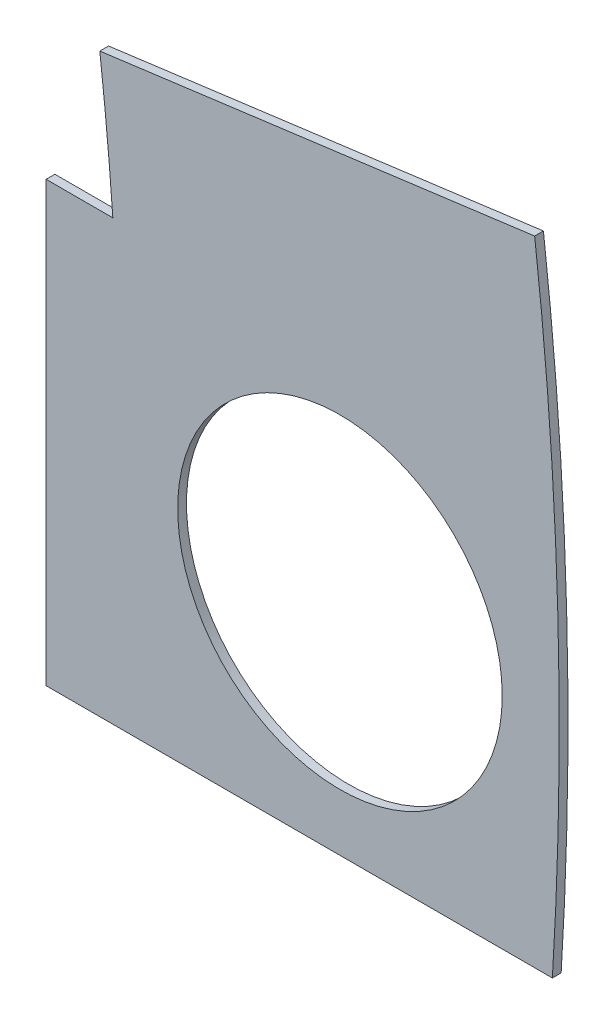
ISO-10303-21;
HEADER;
FILE_DESCRIPTION(('STEP AP214'),'2;1');
FILE_NAME('part.step','',(''),(''),'','','');
FILE_SCHEMA(('AUTOMOTIVE_DESIGN { 1 0 10303 214 1 1 1 1 }'));
ENDSEC;
DATA;
#1=APPLICATION_CONTEXT('core data for automotive mechanical design processes');
#2=APPLICATION_PROTOCOL_DEFINITION('international standard','automotive_design',2000,#1);
#3=PRODUCT_CONTEXT('',#1,'mechanical');
#4=PRODUCT('Part','Part','',(#3));
#5=PRODUCT_RELATED_PRODUCT_CATEGORY('part','',(#4));
#6=PRODUCT_DEFINITION_FORMATION('','',#4);
#7=PRODUCT_DEFINITION_CONTEXT('part definition',#1,'design');
#8=PRODUCT_DEFINITION('design','',#6,#7);
#9=PRODUCT_DEFINITION_SHAPE('','',#8);
#10=(LENGTH_UNIT() NAMED_UNIT(*) SI_UNIT(.MILLI.,.METRE.));
#11=(NAMED_UNIT(*) PLANE_ANGLE_UNIT() SI_UNIT($,.RADIAN.));
#12=(NAMED_UNIT(*) SI_UNIT($,.STERADIAN.) SOLID_ANGLE_UNIT());
#13=UNCERTAINTY_MEASURE_WITH_UNIT(LENGTH_MEASURE(1.E-05),#10,'distance_accuracy_value','');
#14=(GEOMETRIC_REPRESENTATION_CONTEXT(3) GLOBAL_UNCERTAINTY_ASSIGNED_CONTEXT((#13)) GLOBAL_UNIT_ASSIGNED_CONTEXT((#10,
#11,#12)) REPRESENTATION_CONTEXT('',''));
#15=CARTESIAN_POINT('',(0.,0.,0.));
#16=DIRECTION('',(0.,0.,1.));
#17=DIRECTION('',(1.,0.,0.));
#18=AXIS2_PLACEMENT_3D('',#15,#16,#17);
#19=CARTESIAN_POINT('',(0.,0.,0.254));
#20=DIRECTION('',(0.,0.,-1.));
#21=DIRECTION('',(-1.,0.,0.));
#22=AXIS2_PLACEMENT_3D('',#19,#20,#21);
#23=PLANE('',#22);
#24=CARTESIAN_POINT('',(95.25,0.,0.254));
#25=DIRECTION('',(0.,0.,1.));
#26=DIRECTION('',(1.,0.,0.));
#27=AXIS2_PLACEMENT_3D('',#24,#25,#26);
#28=CIRCLE('',#27,4.69899999999999);
#29=CARTESIAN_POINT('',(99.949,0.,0.254));
#30=VERTEX_POINT('',#29);
#31=EDGE_CURVE('E114',#30,#30,#28,.T.);
#32=ORIENTED_EDGE('',*,*,#31,.F.);
#33=EDGE_LOOP('',(#32));
#34=FACE_BOUND('',#33,.T.);
#35=DIRECTION('',(1.,0.,0.));
#36=VECTOR('',#35,1.);
#37=CARTESIAN_POINT('',(88.6729242779328,6.35,0.254));
#38=LINE('',#37,#36);
#39=CARTESIAN_POINT('',(86.741,6.35,0.254));
#40=VERTEX_POINT('',#39);
#41=CARTESIAN_POINT('',(88.6729242779328,6.35,0.254));
#42=VERTEX_POINT('',#41);
#43=EDGE_CURVE('E99',#40,#42,#38,.T.);
#44=ORIENTED_EDGE('',*,*,#43,.F.);
#45=DIRECTION('',(0.,1.,0.));
#46=VECTOR('',#45,1.);
#47=CARTESIAN_POINT('',(86.741,-6.35000000000001,0.254));
#48=LINE('',#47,#46);
#49=CARTESIAN_POINT('',(86.741,-6.35000000000001,0.254));
#50=VERTEX_POINT('',#49);
#51=EDGE_CURVE('E85',#50,#40,#48,.T.);
#52=ORIENTED_EDGE('',*,*,#51,.F.);
#53=DIRECTION('',(1.,0.,0.));
#54=VECTOR('',#53,1.);
#55=CARTESIAN_POINT('',(101.401368333963,-6.35,0.254));
#56=LINE('',#55,#54);
#57=CARTESIAN_POINT('',(101.401368333963,-6.35,0.254));
#58=VERTEX_POINT('',#57);
#59=EDGE_CURVE('E124',#50,#58,#56,.T.);
#60=ORIENTED_EDGE('',*,*,#59,.T.);
#61=CARTESIAN_POINT('',(0.,0.,0.254));
#62=DIRECTION('',(0.,0.,1.));
#63=DIRECTION('',(-1.,0.,0.));
#64=AXIS2_PLACEMENT_3D('',#61,#62,#63);
#65=CIRCLE('',#64,101.6);
#66=CARTESIAN_POINT('',(100.888696278681,12.0012900634879,0.254));
#67=VERTEX_POINT('',#66);
#68=EDGE_CURVE('E121',#58,#67,#65,.T.);
#69=ORIENTED_EDGE('',*,*,#68,.T.);
#70=DIRECTION('',(0.991444861373813,0.130526192220036,0.));
#71=VECTOR('',#70,1.);
#72=CARTESIAN_POINT('',(100.266998692726,11.9194420235529,0.254));
#73=LINE('',#72,#71);
#74=CARTESIAN_POINT('',(88.2962221600934,10.3434593949714,0.254));
#75=VERTEX_POINT('',#74);
#76=EDGE_CURVE('E50',#75,#67,#73,.T.);
#77=ORIENTED_EDGE('',*,*,#76,.F.);
#78=CARTESIAN_POINT('',(0.,0.,0.254));
#79=DIRECTION('',(0.,0.,1.));
#80=DIRECTION('',(-1.,0.,0.));
#81=AXIS2_PLACEMENT_3D('',#78,#79,#80);
#82=CIRCLE('',#81,88.9);
#83=EDGE_CURVE('E106',#42,#75,#82,.T.);
#84=ORIENTED_EDGE('',*,*,#83,.F.);
#85=EDGE_LOOP('',(#44,#52,#60,#69,#77,#84));
#86=FACE_BOUND('',#85,.T.);
#87=ADVANCED_FACE('F35',(#34,#86),#23,.F.);
#88=CARTESIAN_POINT('',(0.,0.,0.));
#89=DIRECTION('',(0.,0.,-1.));
#90=DIRECTION('',(-1.,0.,0.));
#91=AXIS2_PLACEMENT_3D('',#88,#89,#90);
#92=PLANE('',#91);
#93=CARTESIAN_POINT('',(95.25,0.,0.));
#94=DIRECTION('',(0.,0.,1.));
#95=DIRECTION('',(1.,0.,0.));
#96=AXIS2_PLACEMENT_3D('',#93,#94,#95);
#97=CIRCLE('',#96,4.69899999999999);
#98=CARTESIAN_POINT('',(99.949,0.,0.));
#99=VERTEX_POINT('',#98);
#100=EDGE_CURVE('E117',#99,#99,#97,.T.);
#101=ORIENTED_EDGE('',*,*,#100,.T.);
#102=EDGE_LOOP('',(#101));
#103=FACE_BOUND('',#102,.T.);
#104=DIRECTION('',(0.,1.,0.));
#105=VECTOR('',#104,1.);
#106=CARTESIAN_POINT('',(86.741,-6.35000000000001,0.));
#107=LINE('',#106,#105);
#108=CARTESIAN_POINT('',(86.741,-6.35,0.));
#109=VERTEX_POINT('',#108);
#110=CARTESIAN_POINT('',(86.741,6.35,0.));
#111=VERTEX_POINT('',#110);
#112=EDGE_CURVE('E57',#109,#111,#107,.T.);
#113=ORIENTED_EDGE('',*,*,#112,.T.);
#114=DIRECTION('',(1.,0.,0.));
#115=VECTOR('',#114,1.);
#116=CARTESIAN_POINT('',(88.6729242779328,6.35,0.));
#117=LINE('',#116,#115);
#118=CARTESIAN_POINT('',(88.6729242779328,6.35,0.));
#119=VERTEX_POINT('',#118);
#120=EDGE_CURVE('E101',#111,#119,#117,.T.);
#121=ORIENTED_EDGE('',*,*,#120,.T.);
#122=CARTESIAN_POINT('',(0.,0.,0.));
#123=DIRECTION('',(0.,0.,1.));
#124=DIRECTION('',(-1.,0.,0.));
#125=AXIS2_PLACEMENT_3D('',#122,#123,#124);
#126=CIRCLE('',#125,88.9);
#127=CARTESIAN_POINT('',(88.2962221600934,10.3434593949714,0.));
#128=VERTEX_POINT('',#127);
#129=EDGE_CURVE('E107',#119,#128,#126,.T.);
#130=ORIENTED_EDGE('',*,*,#129,.T.);
#131=DIRECTION('',(0.991444861373813,0.130526192220036,0.));
#132=VECTOR('',#131,1.);
#133=CARTESIAN_POINT('',(100.266998692726,11.9194420235529,0.));
#134=LINE('',#133,#132);
#135=CARTESIAN_POINT('',(100.888696278681,12.0012900634879,0.));
#136=VERTEX_POINT('',#135);
#137=EDGE_CURVE('E94',#128,#136,#134,.T.);
#138=ORIENTED_EDGE('',*,*,#137,.T.);
#139=CARTESIAN_POINT('',(0.,0.,0.));
#140=DIRECTION('',(0.,0.,1.));
#141=DIRECTION('',(-1.,0.,0.));
#142=AXIS2_PLACEMENT_3D('',#139,#140,#141);
#143=CIRCLE('',#142,101.6);
#144=CARTESIAN_POINT('',(101.401368333963,-6.35,0.));
#145=VERTEX_POINT('',#144);
#146=EDGE_CURVE('E120',#145,#136,#143,.T.);
#147=ORIENTED_EDGE('',*,*,#146,.F.);
#148=DIRECTION('',(1.,0.,0.));
#149=VECTOR('',#148,1.);
#150=CARTESIAN_POINT('',(101.401368333963,-6.35,0.));
#151=LINE('',#150,#149);
#152=EDGE_CURVE('E125',#109,#145,#151,.T.);
#153=ORIENTED_EDGE('',*,*,#152,.F.);
#154=EDGE_LOOP('',(#113,#121,#130,#138,#147,#153));
#155=FACE_BOUND('',#154,.T.);
#156=ADVANCED_FACE('F138',(#103,#155),#92,.T.);
#157=CARTESIAN_POINT('',(88.6729242779328,6.35,0.254));
#158=DIRECTION('',(0.,1.,0.));
#159=DIRECTION('',(-1.,0.,0.));
#160=AXIS2_PLACEMENT_3D('',#157,#158,#159);
#161=PLANE('',#160);
#162=ORIENTED_EDGE('',*,*,#120,.F.);
#163=DIRECTION('',(0.,0.,1.));
#164=VECTOR('',#163,1.);
#165=CARTESIAN_POINT('',(86.741,6.35,0.254));
#166=LINE('',#165,#164);
#167=EDGE_CURVE('E88',#111,#40,#166,.T.);
#168=ORIENTED_EDGE('',*,*,#167,.T.);
#169=ORIENTED_EDGE('',*,*,#43,.T.);
#170=DIRECTION('',(0.,0.,-1.));
#171=VECTOR('',#170,1.);
#172=CARTESIAN_POINT('',(88.6729242779328,6.35,0.254));
#173=LINE('',#172,#171);
#174=EDGE_CURVE('E109',#42,#119,#173,.T.);
#175=ORIENTED_EDGE('',*,*,#174,.T.);
#176=EDGE_LOOP('',(#162,#168,#169,#175));
#177=FACE_BOUND('',#176,.T.);
#178=ADVANCED_FACE('F97',(#177),#161,.T.);
#179=CARTESIAN_POINT('',(0.,0.,0.254));
#180=DIRECTION('',(0.,0.,-1.));
#181=DIRECTION('',(-1.,0.,0.));
#182=AXIS2_PLACEMENT_3D('',#179,#180,#181);
#183=CYLINDRICAL_SURFACE('',#182,88.9);
#184=ORIENTED_EDGE('',*,*,#83,.T.);
#185=DIRECTION('',(0.,0.,-1.));
#186=VECTOR('',#185,1.);
#187=CARTESIAN_POINT('',(88.2962221600934,10.3434593949714,0.254));
#188=LINE('',#187,#186);
#189=EDGE_CURVE('E102',#75,#128,#188,.T.);
#190=ORIENTED_EDGE('',*,*,#189,.T.);
#191=ORIENTED_EDGE('',*,*,#129,.F.);
#192=ORIENTED_EDGE('',*,*,#174,.F.);
#193=EDGE_LOOP('',(#184,#190,#191,#192));
#194=FACE_BOUND('',#193,.T.);
#195=ADVANCED_FACE('F170',(#194),#183,.F.);
#196=CARTESIAN_POINT('',(0.,0.,0.254));
#197=DIRECTION('',(0.,0.,-1.));
#198=DIRECTION('',(-1.,0.,0.));
#199=AXIS2_PLACEMENT_3D('',#196,#197,#198);
#200=CYLINDRICAL_SURFACE('',#199,101.6);
#201=ORIENTED_EDGE('',*,*,#146,.T.);
#202=DIRECTION('',(0.,0.,-1.));
#203=VECTOR('',#202,1.);
#204=CARTESIAN_POINT('',(100.888696278681,12.0012900634879,0.254));
#205=LINE('',#204,#203);
#206=EDGE_CURVE('E12',#136,#67,#205,.F.);
#207=ORIENTED_EDGE('',*,*,#206,.T.);
#208=ORIENTED_EDGE('',*,*,#68,.F.);
#209=DIRECTION('',(0.,0.,-1.));
#210=VECTOR('',#209,1.);
#211=CARTESIAN_POINT('',(101.401368333963,-6.35,0.254));
#212=LINE('',#211,#210);
#213=EDGE_CURVE('E43',#58,#145,#212,.T.);
#214=ORIENTED_EDGE('',*,*,#213,.T.);
#215=EDGE_LOOP('',(#201,#207,#208,#214));
#216=FACE_BOUND('',#215,.T.);
#217=ADVANCED_FACE('F37',(#216),#200,.T.);
#218=CARTESIAN_POINT('',(101.401368333963,-6.35,0.254));
#219=DIRECTION('',(0.,1.,0.));
#220=DIRECTION('',(-1.,0.,0.));
#221=AXIS2_PLACEMENT_3D('',#218,#219,#220);
#222=PLANE('',#221);
#223=ORIENTED_EDGE('',*,*,#59,.F.);
#224=DIRECTION('',(0.,0.,1.));
#225=VECTOR('',#224,1.);
#226=CARTESIAN_POINT('',(86.741,-6.35000000000001,0.));
#227=LINE('',#226,#225);
#228=EDGE_CURVE('E90',#109,#50,#227,.T.);
#229=ORIENTED_EDGE('',*,*,#228,.F.);
#230=ORIENTED_EDGE('',*,*,#152,.T.);
#231=ORIENTED_EDGE('',*,*,#213,.F.);
#232=EDGE_LOOP('',(#223,#229,#230,#231));
#233=FACE_BOUND('',#232,.T.);
#234=ADVANCED_FACE('F162',(#233),#222,.F.);
#235=CARTESIAN_POINT('',(95.25,0.,0.));
#236=DIRECTION('',(0.,0.,1.));
#237=DIRECTION('',(1.,0.,0.));
#238=AXIS2_PLACEMENT_3D('',#235,#236,#237);
#239=CYLINDRICAL_SURFACE('',#238,4.69899999999999);
#240=ORIENTED_EDGE('',*,*,#100,.F.);
#241=EDGE_LOOP('',(#240));
#242=FACE_BOUND('',#241,.T.);
#243=ORIENTED_EDGE('',*,*,#31,.T.);
#244=EDGE_LOOP('',(#243));
#245=FACE_BOUND('',#244,.T.);
#246=ADVANCED_FACE('F152',(#242,#245),#239,.F.);
#247=CARTESIAN_POINT('',(86.741,-6.35000000000001,0.));
#248=DIRECTION('',(1.,0.,0.));
#249=DIRECTION('',(0.,0.,-1.));
#250=AXIS2_PLACEMENT_3D('',#247,#248,#249);
#251=PLANE('',#250);
#252=ORIENTED_EDGE('',*,*,#51,.T.);
#253=ORIENTED_EDGE('',*,*,#167,.F.);
#254=ORIENTED_EDGE('',*,*,#112,.F.);
#255=ORIENTED_EDGE('',*,*,#228,.T.);
#256=EDGE_LOOP('',(#252,#253,#254,#255));
#257=FACE_BOUND('',#256,.T.);
#258=ADVANCED_FACE('F87',(#257),#251,.F.);
#259=CARTESIAN_POINT('',(100.266998692726,11.9194420235529,0.));
#260=DIRECTION('',(0.130526192220036,-0.991444861373813,0.));
#261=DIRECTION('',(0.991444861373813,0.130526192220036,0.));
#262=AXIS2_PLACEMENT_3D('',#259,#260,#261);
#263=PLANE('',#262);
#264=ORIENTED_EDGE('',*,*,#137,.F.);
#265=ORIENTED_EDGE('',*,*,#189,.F.);
#266=ORIENTED_EDGE('',*,*,#76,.T.);
#267=ORIENTED_EDGE('',*,*,#206,.F.);
#268=EDGE_LOOP('',(#264,#265,#266,#267));
#269=FACE_BOUND('',#268,.T.);
#270=ADVANCED_FACE('F171',(#269),#263,.F.);
#271=CLOSED_SHELL('',(#87,#156,#178,#195,#217,#234,#246,#258,#270));
#272=MANIFOLD_SOLID_BREP('B2',#271);
#273=ADVANCED_BREP_SHAPE_REPRESENTATION('',(#18,#272),#14);
#274=SHAPE_DEFINITION_REPRESENTATION(#9,#273);
ENDSEC;
END-ISO-10303-21;
